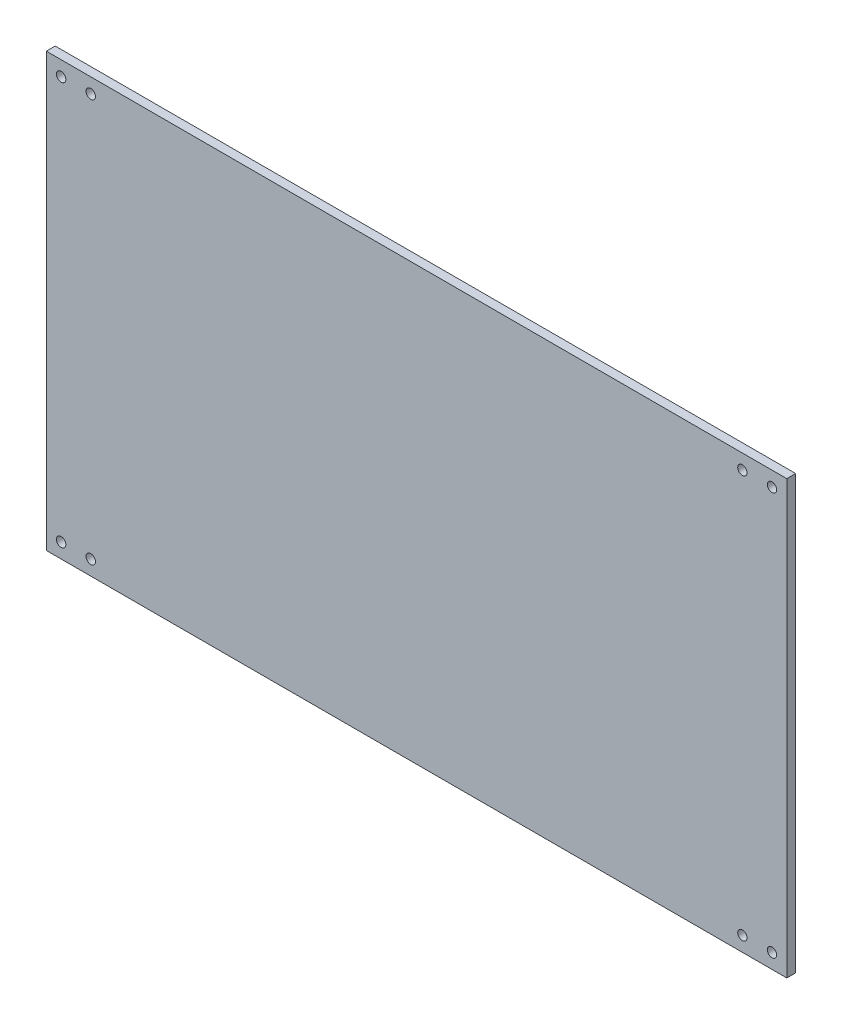
ISO-10303-21;
HEADER;
FILE_DESCRIPTION(('STEP AP214'),'2;1');
FILE_NAME('part.step','',(''),(''),'','','');
FILE_SCHEMA(('AUTOMOTIVE_DESIGN { 1 0 10303 214 1 1 1 1 }'));
ENDSEC;
DATA;
#1=APPLICATION_CONTEXT('core data for automotive mechanical design processes');
#2=APPLICATION_PROTOCOL_DEFINITION('international standard','automotive_design',2000,#1);
#3=PRODUCT_CONTEXT('',#1,'mechanical');
#4=PRODUCT('Part','Part','',(#3));
#5=PRODUCT_RELATED_PRODUCT_CATEGORY('part','',(#4));
#6=PRODUCT_DEFINITION_FORMATION('','',#4);
#7=PRODUCT_DEFINITION_CONTEXT('part definition',#1,'design');
#8=PRODUCT_DEFINITION('design','',#6,#7);
#9=PRODUCT_DEFINITION_SHAPE('','',#8);
#10=(LENGTH_UNIT() NAMED_UNIT(*) SI_UNIT(.MILLI.,.METRE.));
#11=(NAMED_UNIT(*) PLANE_ANGLE_UNIT() SI_UNIT($,.RADIAN.));
#12=(NAMED_UNIT(*) SI_UNIT($,.STERADIAN.) SOLID_ANGLE_UNIT());
#13=UNCERTAINTY_MEASURE_WITH_UNIT(LENGTH_MEASURE(1.E-05),#10,'distance_accuracy_value','');
#14=(GEOMETRIC_REPRESENTATION_CONTEXT(3) GLOBAL_UNCERTAINTY_ASSIGNED_CONTEXT((#13)) GLOBAL_UNIT_ASSIGNED_CONTEXT((#10,
#11,#12)) REPRESENTATION_CONTEXT('',''));
#15=CARTESIAN_POINT('',(0.,0.,0.));
#16=DIRECTION('',(0.,0.,1.));
#17=DIRECTION('',(1.,0.,0.));
#18=AXIS2_PLACEMENT_3D('',#15,#16,#17);
#19=CARTESIAN_POINT('',(0.,0.,3.));
#20=DIRECTION('',(0.,0.,1.));
#21=DIRECTION('',(1.,0.,0.));
#22=AXIS2_PLACEMENT_3D('',#19,#20,#21);
#23=PLANE('',#22);
#24=CARTESIAN_POINT('',(97.0100502512564,64.2788944723618,3.));
#25=DIRECTION('',(0.,0.,1.));
#26=DIRECTION('',(-1.,0.,0.));
#27=AXIS2_PLACEMENT_3D('',#24,#25,#26);
#28=CIRCLE('',#27,1.57031399519121);
#29=CARTESIAN_POINT('',(95.4397362560652,64.2788944723618,3.));
#30=VERTEX_POINT('',#29);
#31=EDGE_CURVE('E153',#30,#30,#28,.T.);
#32=ORIENTED_EDGE('',*,*,#31,.F.);
#33=EDGE_LOOP('',(#32));
#34=FACE_BOUND('',#33,.T.);
#35=CARTESIAN_POINT('',(97.0100502512564,-71.7211055276381,3.));
#36=DIRECTION('',(0.,0.,1.));
#37=DIRECTION('',(1.,0.,0.));
#38=AXIS2_PLACEMENT_3D('',#35,#36,#37);
#39=CIRCLE('',#38,1.57031399519121);
#40=CARTESIAN_POINT('',(98.5803642464476,-71.7211055276381,3.));
#41=VERTEX_POINT('',#40);
#42=EDGE_CURVE('E141',#41,#41,#39,.T.);
#43=ORIENTED_EDGE('',*,*,#42,.F.);
#44=EDGE_LOOP('',(#43));
#45=FACE_BOUND('',#44,.T.);
#46=CARTESIAN_POINT('',(-142.989949748744,64.2788944723618,3.));
#47=DIRECTION('',(0.,0.,1.));
#48=DIRECTION('',(-1.,0.,0.));
#49=AXIS2_PLACEMENT_3D('',#46,#47,#48);
#50=CIRCLE('',#49,1.59999999999999);
#51=CARTESIAN_POINT('',(-144.589949748744,64.2788944723618,3.));
#52=VERTEX_POINT('',#51);
#53=EDGE_CURVE('E129',#52,#52,#50,.T.);
#54=ORIENTED_EDGE('',*,*,#53,.F.);
#55=EDGE_LOOP('',(#54));
#56=FACE_BOUND('',#55,.T.);
#57=CARTESIAN_POINT('',(-142.989949748744,-71.7211055276381,3.));
#58=DIRECTION('',(0.,0.,1.));
#59=DIRECTION('',(1.,0.,0.));
#60=AXIS2_PLACEMENT_3D('',#57,#58,#59);
#61=CIRCLE('',#60,1.59999999999999);
#62=CARTESIAN_POINT('',(-141.389949748744,-71.7211055276381,3.));
#63=VERTEX_POINT('',#62);
#64=EDGE_CURVE('E108',#63,#63,#61,.T.);
#65=ORIENTED_EDGE('',*,*,#64,.F.);
#66=EDGE_LOOP('',(#65));
#67=FACE_BOUND('',#66,.T.);
#68=DIRECTION('',(0.,-1.,0.));
#69=VECTOR('',#68,1.);
#70=CARTESIAN_POINT('',(-147.989949748744,69.2788944723618,3.));
#71=LINE('',#70,#69);
#72=CARTESIAN_POINT('',(-147.989949748744,69.2788944723618,3.));
#73=VERTEX_POINT('',#72);
#74=CARTESIAN_POINT('',(-147.989949748744,-76.7211055276382,3.));
#75=VERTEX_POINT('',#74);
#76=EDGE_CURVE('E93',#73,#75,#71,.T.);
#77=ORIENTED_EDGE('',*,*,#76,.T.);
#78=DIRECTION('',(1.,0.,0.));
#79=VECTOR('',#78,1.);
#80=CARTESIAN_POINT('',(-147.989949748744,-76.7211055276382,3.));
#81=LINE('',#80,#79);
#82=CARTESIAN_POINT('',(102.010050251256,-76.7211055276382,3.));
#83=VERTEX_POINT('',#82);
#84=EDGE_CURVE('E88',#75,#83,#81,.T.);
#85=ORIENTED_EDGE('',*,*,#84,.T.);
#86=DIRECTION('',(0.,1.,0.));
#87=VECTOR('',#86,1.);
#88=CARTESIAN_POINT('',(102.010050251256,69.2788944723618,3.));
#89=LINE('',#88,#87);
#90=CARTESIAN_POINT('',(102.010050251256,69.2788944723618,3.));
#91=VERTEX_POINT('',#90);
#92=EDGE_CURVE('E91',#83,#91,#89,.T.);
#93=ORIENTED_EDGE('',*,*,#92,.T.);
#94=DIRECTION('',(-1.,0.,0.));
#95=VECTOR('',#94,1.);
#96=CARTESIAN_POINT('',(-147.989949748744,69.2788944723618,3.));
#97=LINE('',#96,#95);
#98=EDGE_CURVE('E58',#91,#73,#97,.T.);
#99=ORIENTED_EDGE('',*,*,#98,.T.);
#100=EDGE_LOOP('',(#77,#85,#93,#99));
#101=FACE_BOUND('',#100,.T.);
#102=CARTESIAN_POINT('',(-132.989949748744,-71.7211055276381,3.));
#103=DIRECTION('',(0.,0.,1.));
#104=DIRECTION('',(1.,0.,0.));
#105=AXIS2_PLACEMENT_3D('',#102,#103,#104);
#106=CIRCLE('',#105,1.59999999999999);
#107=CARTESIAN_POINT('',(-131.389949748744,-71.7211055276381,3.));
#108=VERTEX_POINT('',#107);
#109=EDGE_CURVE('E123',#108,#108,#106,.T.);
#110=ORIENTED_EDGE('',*,*,#109,.F.);
#111=EDGE_LOOP('',(#110));
#112=FACE_BOUND('',#111,.T.);
#113=CARTESIAN_POINT('',(-132.989949748744,64.2788944723618,3.));
#114=DIRECTION('',(0.,0.,1.));
#115=DIRECTION('',(-1.,0.,0.));
#116=AXIS2_PLACEMENT_3D('',#113,#114,#115);
#117=CIRCLE('',#116,1.59999999999999);
#118=CARTESIAN_POINT('',(-134.589949748744,64.2788944723618,3.));
#119=VERTEX_POINT('',#118);
#120=EDGE_CURVE('E135',#119,#119,#117,.T.);
#121=ORIENTED_EDGE('',*,*,#120,.F.);
#122=EDGE_LOOP('',(#121));
#123=FACE_BOUND('',#122,.T.);
#124=CARTESIAN_POINT('',(87.0100502512564,-71.7211055276381,3.));
#125=DIRECTION('',(0.,0.,1.));
#126=DIRECTION('',(1.,0.,0.));
#127=AXIS2_PLACEMENT_3D('',#124,#125,#126);
#128=CIRCLE('',#127,1.57031399519121);
#129=CARTESIAN_POINT('',(88.5803642464476,-71.7211055276381,3.));
#130=VERTEX_POINT('',#129);
#131=EDGE_CURVE('E147',#130,#130,#128,.T.);
#132=ORIENTED_EDGE('',*,*,#131,.F.);
#133=EDGE_LOOP('',(#132));
#134=FACE_BOUND('',#133,.T.);
#135=CARTESIAN_POINT('',(87.0100502512564,64.2788944723618,3.));
#136=DIRECTION('',(0.,0.,1.));
#137=DIRECTION('',(-1.,0.,0.));
#138=AXIS2_PLACEMENT_3D('',#135,#136,#137);
#139=CIRCLE('',#138,1.57031399519121);
#140=CARTESIAN_POINT('',(85.4397362560652,64.2788944723618,3.));
#141=VERTEX_POINT('',#140);
#142=EDGE_CURVE('E159',#141,#141,#139,.T.);
#143=ORIENTED_EDGE('',*,*,#142,.F.);
#144=EDGE_LOOP('',(#143));
#145=FACE_BOUND('',#144,.T.);
#146=ADVANCED_FACE('F41',(#34,#45,#56,#67,#101,#112,#123,#134,#145),#23,.T.);
#147=CARTESIAN_POINT('',(0.,0.,0.));
#148=DIRECTION('',(0.,0.,1.));
#149=DIRECTION('',(1.,0.,0.));
#150=AXIS2_PLACEMENT_3D('',#147,#148,#149);
#151=PLANE('',#150);
#152=DIRECTION('',(0.,-1.,0.));
#153=VECTOR('',#152,1.);
#154=CARTESIAN_POINT('',(-147.989949748744,69.2788944723618,0.));
#155=LINE('',#154,#153);
#156=CARTESIAN_POINT('',(-147.989949748744,69.2788944723618,0.));
#157=VERTEX_POINT('',#156);
#158=CARTESIAN_POINT('',(-147.989949748744,-76.7211055276382,0.));
#159=VERTEX_POINT('',#158);
#160=EDGE_CURVE('E105',#157,#159,#155,.T.);
#161=ORIENTED_EDGE('',*,*,#160,.F.);
#162=DIRECTION('',(-1.,0.,0.));
#163=VECTOR('',#162,1.);
#164=CARTESIAN_POINT('',(-147.989949748744,69.2788944723618,0.));
#165=LINE('',#164,#163);
#166=CARTESIAN_POINT('',(102.010050251256,69.2788944723618,0.));
#167=VERTEX_POINT('',#166);
#168=EDGE_CURVE('E81',#167,#157,#165,.T.);
#169=ORIENTED_EDGE('',*,*,#168,.F.);
#170=DIRECTION('',(0.,1.,0.));
#171=VECTOR('',#170,1.);
#172=CARTESIAN_POINT('',(102.010050251256,69.2788944723618,0.));
#173=LINE('',#172,#171);
#174=CARTESIAN_POINT('',(102.010050251256,-76.7211055276382,0.));
#175=VERTEX_POINT('',#174);
#176=EDGE_CURVE('E75',#175,#167,#173,.T.);
#177=ORIENTED_EDGE('',*,*,#176,.F.);
#178=DIRECTION('',(1.,0.,0.));
#179=VECTOR('',#178,1.);
#180=CARTESIAN_POINT('',(-147.989949748744,-76.7211055276382,0.));
#181=LINE('',#180,#179);
#182=EDGE_CURVE('E97',#159,#175,#181,.T.);
#183=ORIENTED_EDGE('',*,*,#182,.F.);
#184=EDGE_LOOP('',(#161,#169,#177,#183));
#185=FACE_BOUND('',#184,.T.);
#186=CARTESIAN_POINT('',(-142.989949748744,-71.7211055276381,0.));
#187=DIRECTION('',(0.,0.,1.));
#188=DIRECTION('',(1.,0.,0.));
#189=AXIS2_PLACEMENT_3D('',#186,#187,#188);
#190=CIRCLE('',#189,1.59999999999999);
#191=CARTESIAN_POINT('',(-141.389949748744,-71.7211055276381,0.));
#192=VERTEX_POINT('',#191);
#193=EDGE_CURVE('E120',#192,#192,#190,.T.);
#194=ORIENTED_EDGE('',*,*,#193,.T.);
#195=EDGE_LOOP('',(#194));
#196=FACE_BOUND('',#195,.T.);
#197=CARTESIAN_POINT('',(-132.989949748744,-71.7211055276381,0.));
#198=DIRECTION('',(0.,0.,1.));
#199=DIRECTION('',(1.,0.,0.));
#200=AXIS2_PLACEMENT_3D('',#197,#198,#199);
#201=CIRCLE('',#200,1.59999999999999);
#202=CARTESIAN_POINT('',(-131.389949748744,-71.7211055276381,0.));
#203=VERTEX_POINT('',#202);
#204=EDGE_CURVE('E126',#203,#203,#201,.T.);
#205=ORIENTED_EDGE('',*,*,#204,.T.);
#206=EDGE_LOOP('',(#205));
#207=FACE_BOUND('',#206,.T.);
#208=CARTESIAN_POINT('',(-142.989949748744,64.2788944723618,0.));
#209=DIRECTION('',(0.,0.,1.));
#210=DIRECTION('',(-1.,0.,0.));
#211=AXIS2_PLACEMENT_3D('',#208,#209,#210);
#212=CIRCLE('',#211,1.59999999999999);
#213=CARTESIAN_POINT('',(-144.589949748744,64.2788944723618,0.));
#214=VERTEX_POINT('',#213);
#215=EDGE_CURVE('E132',#214,#214,#212,.T.);
#216=ORIENTED_EDGE('',*,*,#215,.T.);
#217=EDGE_LOOP('',(#216));
#218=FACE_BOUND('',#217,.T.);
#219=CARTESIAN_POINT('',(-132.989949748744,64.2788944723618,0.));
#220=DIRECTION('',(0.,0.,1.));
#221=DIRECTION('',(-1.,0.,0.));
#222=AXIS2_PLACEMENT_3D('',#219,#220,#221);
#223=CIRCLE('',#222,1.59999999999999);
#224=CARTESIAN_POINT('',(-134.589949748744,64.2788944723618,0.));
#225=VERTEX_POINT('',#224);
#226=EDGE_CURVE('E138',#225,#225,#223,.T.);
#227=ORIENTED_EDGE('',*,*,#226,.T.);
#228=EDGE_LOOP('',(#227));
#229=FACE_BOUND('',#228,.T.);
#230=CARTESIAN_POINT('',(97.0100502512564,-71.7211055276381,0.));
#231=DIRECTION('',(0.,0.,1.));
#232=DIRECTION('',(1.,0.,0.));
#233=AXIS2_PLACEMENT_3D('',#230,#231,#232);
#234=CIRCLE('',#233,1.57031399519121);
#235=CARTESIAN_POINT('',(98.5803642464476,-71.7211055276381,0.));
#236=VERTEX_POINT('',#235);
#237=EDGE_CURVE('E144',#236,#236,#234,.T.);
#238=ORIENTED_EDGE('',*,*,#237,.T.);
#239=EDGE_LOOP('',(#238));
#240=FACE_BOUND('',#239,.T.);
#241=CARTESIAN_POINT('',(87.0100502512564,-71.7211055276381,0.));
#242=DIRECTION('',(0.,0.,1.));
#243=DIRECTION('',(1.,0.,0.));
#244=AXIS2_PLACEMENT_3D('',#241,#242,#243);
#245=CIRCLE('',#244,1.57031399519121);
#246=CARTESIAN_POINT('',(88.5803642464476,-71.7211055276381,0.));
#247=VERTEX_POINT('',#246);
#248=EDGE_CURVE('E150',#247,#247,#245,.T.);
#249=ORIENTED_EDGE('',*,*,#248,.T.);
#250=EDGE_LOOP('',(#249));
#251=FACE_BOUND('',#250,.T.);
#252=CARTESIAN_POINT('',(97.0100502512564,64.2788944723618,0.));
#253=DIRECTION('',(0.,0.,1.));
#254=DIRECTION('',(-1.,0.,0.));
#255=AXIS2_PLACEMENT_3D('',#252,#253,#254);
#256=CIRCLE('',#255,1.57031399519121);
#257=CARTESIAN_POINT('',(95.4397362560652,64.2788944723618,0.));
#258=VERTEX_POINT('',#257);
#259=EDGE_CURVE('E156',#258,#258,#256,.T.);
#260=ORIENTED_EDGE('',*,*,#259,.T.);
#261=EDGE_LOOP('',(#260));
#262=FACE_BOUND('',#261,.T.);
#263=CARTESIAN_POINT('',(87.0100502512564,64.2788944723618,0.));
#264=DIRECTION('',(0.,0.,1.));
#265=DIRECTION('',(-1.,0.,0.));
#266=AXIS2_PLACEMENT_3D('',#263,#264,#265);
#267=CIRCLE('',#266,1.57031399519121);
#268=CARTESIAN_POINT('',(85.4397362560652,64.2788944723618,0.));
#269=VERTEX_POINT('',#268);
#270=EDGE_CURVE('E162',#269,#269,#267,.T.);
#271=ORIENTED_EDGE('',*,*,#270,.T.);
#272=EDGE_LOOP('',(#271));
#273=FACE_BOUND('',#272,.T.);
#274=ADVANCED_FACE('F116',(#185,#196,#207,#218,#229,#240,#251,#262,#273),#151,.F.);
#275=CARTESIAN_POINT('',(-147.989949748744,69.2788944723618,3.));
#276=DIRECTION('',(1.,0.,0.));
#277=DIRECTION('',(0.,0.,-1.));
#278=AXIS2_PLACEMENT_3D('',#275,#276,#277);
#279=PLANE('',#278);
#280=ORIENTED_EDGE('',*,*,#160,.T.);
#281=DIRECTION('',(0.,0.,-1.));
#282=VECTOR('',#281,1.);
#283=CARTESIAN_POINT('',(-147.989949748744,-76.7211055276382,3.));
#284=LINE('',#283,#282);
#285=EDGE_CURVE('E11',#75,#159,#284,.T.);
#286=ORIENTED_EDGE('',*,*,#285,.F.);
#287=ORIENTED_EDGE('',*,*,#76,.F.);
#288=DIRECTION('',(0.,0.,-1.));
#289=VECTOR('',#288,1.);
#290=CARTESIAN_POINT('',(-147.989949748744,69.2788944723618,3.));
#291=LINE('',#290,#289);
#292=EDGE_CURVE('E101',#73,#157,#291,.T.);
#293=ORIENTED_EDGE('',*,*,#292,.T.);
#294=EDGE_LOOP('',(#280,#286,#287,#293));
#295=FACE_BOUND('',#294,.T.);
#296=ADVANCED_FACE('F43',(#295),#279,.F.);
#297=CARTESIAN_POINT('',(-147.989949748744,-76.7211055276382,3.));
#298=DIRECTION('',(0.,1.,0.));
#299=DIRECTION('',(0.,0.,1.));
#300=AXIS2_PLACEMENT_3D('',#297,#298,#299);
#301=PLANE('',#300);
#302=ORIENTED_EDGE('',*,*,#182,.T.);
#303=DIRECTION('',(0.,0.,-1.));
#304=VECTOR('',#303,1.);
#305=CARTESIAN_POINT('',(102.010050251256,-76.7211055276382,3.));
#306=LINE('',#305,#304);
#307=EDGE_CURVE('E50',#83,#175,#306,.T.);
#308=ORIENTED_EDGE('',*,*,#307,.F.);
#309=ORIENTED_EDGE('',*,*,#84,.F.);
#310=ORIENTED_EDGE('',*,*,#285,.T.);
#311=EDGE_LOOP('',(#302,#308,#309,#310));
#312=FACE_BOUND('',#311,.T.);
#313=ADVANCED_FACE('F96',(#312),#301,.F.);
#314=CARTESIAN_POINT('',(102.010050251256,69.2788944723618,3.));
#315=DIRECTION('',(-1.,0.,0.));
#316=DIRECTION('',(0.,0.,1.));
#317=AXIS2_PLACEMENT_3D('',#314,#315,#316);
#318=PLANE('',#317);
#319=ORIENTED_EDGE('',*,*,#176,.T.);
#320=DIRECTION('',(0.,0.,-1.));
#321=VECTOR('',#320,1.);
#322=CARTESIAN_POINT('',(102.010050251256,69.2788944723618,3.));
#323=LINE('',#322,#321);
#324=EDGE_CURVE('E98',#91,#167,#323,.T.);
#325=ORIENTED_EDGE('',*,*,#324,.F.);
#326=ORIENTED_EDGE('',*,*,#92,.F.);
#327=ORIENTED_EDGE('',*,*,#307,.T.);
#328=EDGE_LOOP('',(#319,#325,#326,#327));
#329=FACE_BOUND('',#328,.T.);
#330=ADVANCED_FACE('F99',(#329),#318,.F.);
#331=CARTESIAN_POINT('',(-147.989949748744,69.2788944723618,3.));
#332=DIRECTION('',(0.,-1.,0.));
#333=DIRECTION('',(0.,0.,-1.));
#334=AXIS2_PLACEMENT_3D('',#331,#332,#333);
#335=PLANE('',#334);
#336=ORIENTED_EDGE('',*,*,#168,.T.);
#337=ORIENTED_EDGE('',*,*,#292,.F.);
#338=ORIENTED_EDGE('',*,*,#98,.F.);
#339=ORIENTED_EDGE('',*,*,#324,.T.);
#340=EDGE_LOOP('',(#336,#337,#338,#339));
#341=FACE_BOUND('',#340,.T.);
#342=ADVANCED_FACE('F113',(#341),#335,.F.);
#343=CARTESIAN_POINT('',(-142.989949748744,-71.7211055276381,3.));
#344=DIRECTION('',(0.,0.,-1.));
#345=DIRECTION('',(-1.,0.,0.));
#346=AXIS2_PLACEMENT_3D('',#343,#344,#345);
#347=CYLINDRICAL_SURFACE('',#346,1.59999999999999);
#348=ORIENTED_EDGE('',*,*,#64,.T.);
#349=EDGE_LOOP('',(#348));
#350=FACE_BOUND('',#349,.T.);
#351=ORIENTED_EDGE('',*,*,#193,.F.);
#352=EDGE_LOOP('',(#351));
#353=FACE_BOUND('',#352,.T.);
#354=ADVANCED_FACE('F181',(#350,#353),#347,.F.);
#355=CARTESIAN_POINT('',(-132.989949748744,-71.7211055276381,3.));
#356=DIRECTION('',(0.,0.,-1.));
#357=DIRECTION('',(-1.,0.,0.));
#358=AXIS2_PLACEMENT_3D('',#355,#356,#357);
#359=CYLINDRICAL_SURFACE('',#358,1.59999999999999);
#360=ORIENTED_EDGE('',*,*,#109,.T.);
#361=EDGE_LOOP('',(#360));
#362=FACE_BOUND('',#361,.T.);
#363=ORIENTED_EDGE('',*,*,#204,.F.);
#364=EDGE_LOOP('',(#363));
#365=FACE_BOUND('',#364,.T.);
#366=ADVANCED_FACE('F235',(#362,#365),#359,.F.);
#367=CARTESIAN_POINT('',(-142.989949748744,64.2788944723618,3.));
#368=DIRECTION('',(0.,0.,-1.));
#369=DIRECTION('',(-1.,0.,0.));
#370=AXIS2_PLACEMENT_3D('',#367,#368,#369);
#371=CYLINDRICAL_SURFACE('',#370,1.59999999999999);
#372=ORIENTED_EDGE('',*,*,#53,.T.);
#373=EDGE_LOOP('',(#372));
#374=FACE_BOUND('',#373,.T.);
#375=ORIENTED_EDGE('',*,*,#215,.F.);
#376=EDGE_LOOP('',(#375));
#377=FACE_BOUND('',#376,.T.);
#378=ADVANCED_FACE('F244',(#374,#377),#371,.F.);
#379=CARTESIAN_POINT('',(-132.989949748744,64.2788944723618,3.));
#380=DIRECTION('',(0.,0.,-1.));
#381=DIRECTION('',(-1.,0.,0.));
#382=AXIS2_PLACEMENT_3D('',#379,#380,#381);
#383=CYLINDRICAL_SURFACE('',#382,1.59999999999999);
#384=ORIENTED_EDGE('',*,*,#120,.T.);
#385=EDGE_LOOP('',(#384));
#386=FACE_BOUND('',#385,.T.);
#387=ORIENTED_EDGE('',*,*,#226,.F.);
#388=EDGE_LOOP('',(#387));
#389=FACE_BOUND('',#388,.T.);
#390=ADVANCED_FACE('F253',(#386,#389),#383,.F.);
#391=CARTESIAN_POINT('',(97.0100502512564,-71.7211055276381,3.));
#392=DIRECTION('',(0.,0.,-1.));
#393=DIRECTION('',(-1.,0.,0.));
#394=AXIS2_PLACEMENT_3D('',#391,#392,#393);
#395=CYLINDRICAL_SURFACE('',#394,1.57031399519121);
#396=ORIENTED_EDGE('',*,*,#42,.T.);
#397=EDGE_LOOP('',(#396));
#398=FACE_BOUND('',#397,.T.);
#399=ORIENTED_EDGE('',*,*,#237,.F.);
#400=EDGE_LOOP('',(#399));
#401=FACE_BOUND('',#400,.T.);
#402=ADVANCED_FACE('F263',(#398,#401),#395,.F.);
#403=CARTESIAN_POINT('',(87.0100502512564,-71.7211055276381,3.));
#404=DIRECTION('',(0.,0.,-1.));
#405=DIRECTION('',(-1.,0.,0.));
#406=AXIS2_PLACEMENT_3D('',#403,#404,#405);
#407=CYLINDRICAL_SURFACE('',#406,1.57031399519121);
#408=ORIENTED_EDGE('',*,*,#131,.T.);
#409=EDGE_LOOP('',(#408));
#410=FACE_BOUND('',#409,.T.);
#411=ORIENTED_EDGE('',*,*,#248,.F.);
#412=EDGE_LOOP('',(#411));
#413=FACE_BOUND('',#412,.T.);
#414=ADVANCED_FACE('F273',(#410,#413),#407,.F.);
#415=CARTESIAN_POINT('',(97.0100502512564,64.2788944723618,3.));
#416=DIRECTION('',(0.,0.,-1.));
#417=DIRECTION('',(-1.,0.,0.));
#418=AXIS2_PLACEMENT_3D('',#415,#416,#417);
#419=CYLINDRICAL_SURFACE('',#418,1.57031399519121);
#420=ORIENTED_EDGE('',*,*,#31,.T.);
#421=EDGE_LOOP('',(#420));
#422=FACE_BOUND('',#421,.T.);
#423=ORIENTED_EDGE('',*,*,#259,.F.);
#424=EDGE_LOOP('',(#423));
#425=FACE_BOUND('',#424,.T.);
#426=ADVANCED_FACE('F283',(#422,#425),#419,.F.);
#427=CARTESIAN_POINT('',(87.0100502512564,64.2788944723618,3.));
#428=DIRECTION('',(0.,0.,-1.));
#429=DIRECTION('',(-1.,0.,0.));
#430=AXIS2_PLACEMENT_3D('',#427,#428,#429);
#431=CYLINDRICAL_SURFACE('',#430,1.57031399519121);
#432=ORIENTED_EDGE('',*,*,#142,.T.);
#433=EDGE_LOOP('',(#432));
#434=FACE_BOUND('',#433,.T.);
#435=ORIENTED_EDGE('',*,*,#270,.F.);
#436=EDGE_LOOP('',(#435));
#437=FACE_BOUND('',#436,.T.);
#438=ADVANCED_FACE('F168',(#434,#437),#431,.F.);
#439=CLOSED_SHELL('',(#146,#274,#296,#313,#330,#342,#354,#366,#378,#390,#402,#414,#426,#438));
#440=MANIFOLD_SOLID_BREP('B2',#439);
#441=ADVANCED_BREP_SHAPE_REPRESENTATION('',(#18,#440),#14);
#442=SHAPE_DEFINITION_REPRESENTATION(#9,#441);
ENDSEC;
END-ISO-10303-21;
